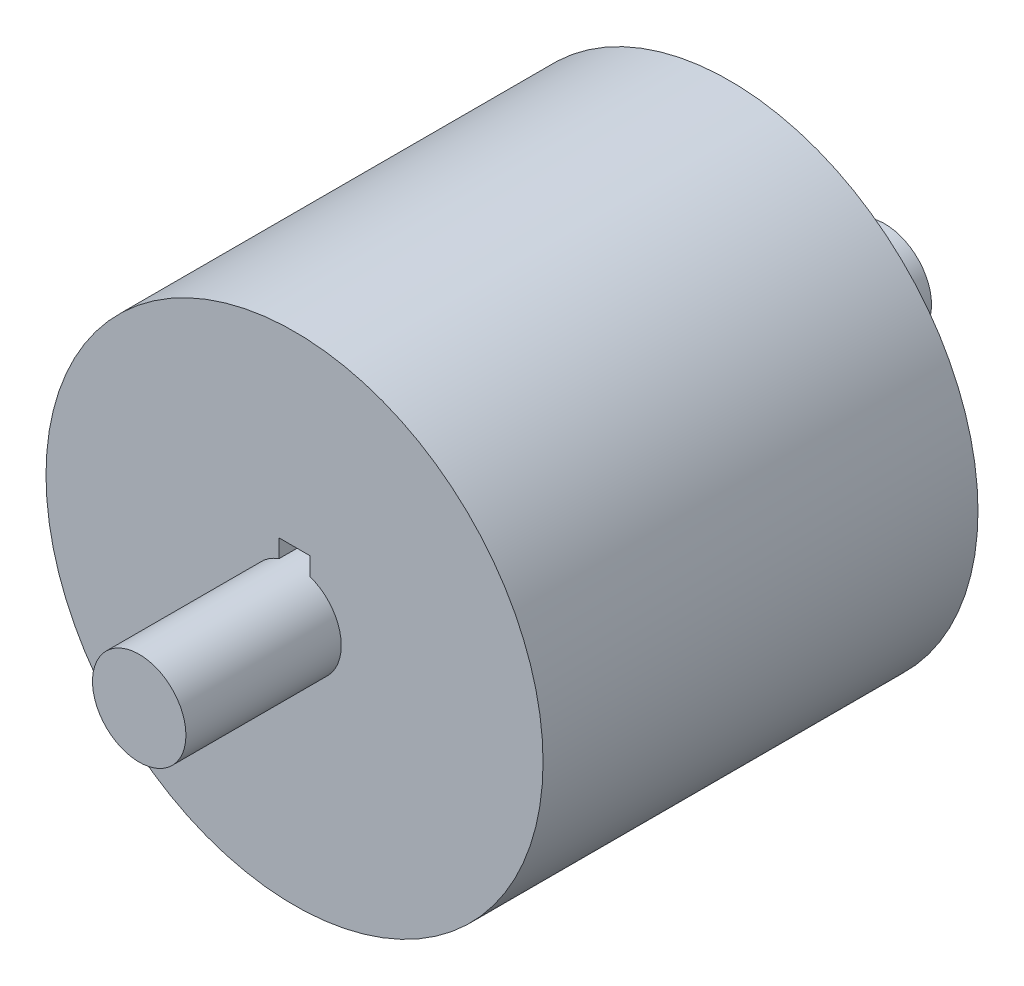
ISO-10303-21;
HEADER;
FILE_DESCRIPTION(('STEP AP214'),'2;1');
FILE_NAME('part.step','',(''),(''),'','','');
FILE_SCHEMA(('AUTOMOTIVE_DESIGN { 1 0 10303 214 1 1 1 1 }'));
ENDSEC;
DATA;
#1=APPLICATION_CONTEXT('core data for automotive mechanical design processes');
#2=APPLICATION_PROTOCOL_DEFINITION('international standard','automotive_design',2000,#1);
#3=PRODUCT_CONTEXT('',#1,'mechanical');
#4=PRODUCT('Part','Part','',(#3));
#5=PRODUCT_RELATED_PRODUCT_CATEGORY('part','',(#4));
#6=PRODUCT_DEFINITION_FORMATION('','',#4);
#7=PRODUCT_DEFINITION_CONTEXT('part definition',#1,'design');
#8=PRODUCT_DEFINITION('design','',#6,#7);
#9=PRODUCT_DEFINITION_SHAPE('','',#8);
#10=(LENGTH_UNIT() NAMED_UNIT(*) SI_UNIT(.MILLI.,.METRE.));
#11=(NAMED_UNIT(*) PLANE_ANGLE_UNIT() SI_UNIT($,.RADIAN.));
#12=(NAMED_UNIT(*) SI_UNIT($,.STERADIAN.) SOLID_ANGLE_UNIT());
#13=UNCERTAINTY_MEASURE_WITH_UNIT(LENGTH_MEASURE(1.E-05),#10,'distance_accuracy_value','');
#14=(GEOMETRIC_REPRESENTATION_CONTEXT(3) GLOBAL_UNCERTAINTY_ASSIGNED_CONTEXT((#13)) GLOBAL_UNIT_ASSIGNED_CONTEXT((#10,
#11,#12)) REPRESENTATION_CONTEXT('',''));
#15=CARTESIAN_POINT('',(0.,0.,0.));
#16=DIRECTION('',(0.,0.,1.));
#17=DIRECTION('',(1.,0.,0.));
#18=AXIS2_PLACEMENT_3D('',#15,#16,#17);
#19=CARTESIAN_POINT('',(0.,0.,11.1125));
#20=DIRECTION('',(0.,0.,1.));
#21=DIRECTION('',(1.,0.,0.));
#22=AXIS2_PLACEMENT_3D('',#19,#20,#21);
#23=PLANE('',#22);
#24=CARTESIAN_POINT('',(0.,0.,11.1125));
#25=DIRECTION('',(0.,0.,1.));
#26=DIRECTION('',(1.,0.,0.));
#27=AXIS2_PLACEMENT_3D('',#24,#25,#26);
#28=CIRCLE('',#27,12.7);
#29=CARTESIAN_POINT('',(12.7,0.,11.1125));
#30=VERTEX_POINT('',#29);
#31=EDGE_CURVE('E41',#30,#30,#28,.T.);
#32=ORIENTED_EDGE('',*,*,#31,.T.);
#33=EDGE_LOOP('',(#32));
#34=FACE_BOUND('',#33,.T.);
#35=DIRECTION('',(0.,-1.,0.));
#36=VECTOR('',#35,1.);
#37=CARTESIAN_POINT('',(0.793750000000004,-28.0814213562373,11.1125));
#38=LINE('',#37,#36);
#39=CARTESIAN_POINT('',(0.79375,3.175,11.1125));
#40=VERTEX_POINT('',#39);
#41=CARTESIAN_POINT('',(0.79375,2.25179810318332,11.1125));
#42=VERTEX_POINT('',#41);
#43=EDGE_CURVE('E99',#40,#42,#38,.T.);
#44=ORIENTED_EDGE('',*,*,#43,.T.);
#45=CARTESIAN_POINT('',(0.,0.,11.1125));
#46=DIRECTION('',(0.,0.,1.));
#47=DIRECTION('',(1.,0.,0.));
#48=AXIS2_PLACEMENT_3D('',#45,#46,#47);
#49=CIRCLE('',#48,2.3876);
#50=CARTESIAN_POINT('',(-0.79375,2.25179810318332,11.1125));
#51=VERTEX_POINT('',#50);
#52=EDGE_CURVE('E48',#42,#51,#49,.F.);
#53=ORIENTED_EDGE('',*,*,#52,.T.);
#54=DIRECTION('',(0.,-1.,0.));
#55=VECTOR('',#54,1.);
#56=CARTESIAN_POINT('',(-0.793749999999996,-28.0814213562373,11.1125));
#57=LINE('',#56,#55);
#58=CARTESIAN_POINT('',(-0.79375,3.175,11.1125));
#59=VERTEX_POINT('',#58);
#60=EDGE_CURVE('E88',#59,#51,#57,.T.);
#61=ORIENTED_EDGE('',*,*,#60,.F.);
#62=DIRECTION('',(1.,0.,0.));
#63=VECTOR('',#62,1.);
#64=CARTESIAN_POINT('',(0.,3.175,11.1125));
#65=LINE('',#64,#63);
#66=EDGE_CURVE('E92',#59,#40,#65,.T.);
#67=ORIENTED_EDGE('',*,*,#66,.T.);
#68=EDGE_LOOP('',(#44,#53,#61,#67));
#69=FACE_BOUND('',#68,.T.);
#70=ADVANCED_FACE('F33',(#34,#69),#23,.T.);
#71=CARTESIAN_POINT('',(0.,0.,-11.1125));
#72=DIRECTION('',(0.,0.,1.));
#73=DIRECTION('',(1.,0.,0.));
#74=AXIS2_PLACEMENT_3D('',#71,#72,#73);
#75=PLANE('',#74);
#76=CARTESIAN_POINT('',(0.,0.,-11.1125));
#77=DIRECTION('',(0.,0.,1.));
#78=DIRECTION('',(1.,0.,0.));
#79=AXIS2_PLACEMENT_3D('',#76,#77,#78);
#80=CIRCLE('',#79,12.7);
#81=CARTESIAN_POINT('',(12.7,0.,-11.1125));
#82=VERTEX_POINT('',#81);
#83=EDGE_CURVE('E105',#82,#82,#80,.T.);
#84=ORIENTED_EDGE('',*,*,#83,.F.);
#85=EDGE_LOOP('',(#84));
#86=FACE_BOUND('',#85,.T.);
#87=CARTESIAN_POINT('',(0.,0.,-11.1125));
#88=DIRECTION('',(0.,0.,1.));
#89=DIRECTION('',(1.,0.,0.));
#90=AXIS2_PLACEMENT_3D('',#87,#88,#89);
#91=CIRCLE('',#90,2.3876);
#92=CARTESIAN_POINT('',(0.79375,2.25179810318332,-11.1125));
#93=VERTEX_POINT('',#92);
#94=CARTESIAN_POINT('',(-0.79375,2.25179810318332,-11.1125));
#95=VERTEX_POINT('',#94);
#96=EDGE_CURVE('E73',#93,#95,#91,.F.);
#97=ORIENTED_EDGE('',*,*,#96,.F.);
#98=DIRECTION('',(0.,-1.,0.));
#99=VECTOR('',#98,1.);
#100=CARTESIAN_POINT('',(0.793750000000004,-28.0814213562373,-11.1125));
#101=LINE('',#100,#99);
#102=CARTESIAN_POINT('',(0.79375,3.175,-11.1125));
#103=VERTEX_POINT('',#102);
#104=EDGE_CURVE('E81',#103,#93,#101,.T.);
#105=ORIENTED_EDGE('',*,*,#104,.F.);
#106=DIRECTION('',(1.,0.,0.));
#107=VECTOR('',#106,1.);
#108=CARTESIAN_POINT('',(0.,3.175,-11.1125));
#109=LINE('',#108,#107);
#110=CARTESIAN_POINT('',(-0.79375,3.175,-11.1125));
#111=VERTEX_POINT('',#110);
#112=EDGE_CURVE('E87',#111,#103,#109,.T.);
#113=ORIENTED_EDGE('',*,*,#112,.F.);
#114=DIRECTION('',(0.,-1.,0.));
#115=VECTOR('',#114,1.);
#116=CARTESIAN_POINT('',(-0.793749999999996,-28.0814213562373,-11.1125));
#117=LINE('',#116,#115);
#118=EDGE_CURVE('E83',#111,#95,#117,.T.);
#119=ORIENTED_EDGE('',*,*,#118,.T.);
#120=EDGE_LOOP('',(#97,#105,#113,#119));
#121=FACE_BOUND('',#120,.T.);
#122=ADVANCED_FACE('F79',(#86,#121),#75,.F.);
#123=CARTESIAN_POINT('',(-0.793749999999996,-28.0814213562373,-11.1125));
#124=DIRECTION('',(-1.,0.,0.));
#125=DIRECTION('',(0.,-1.,0.));
#126=AXIS2_PLACEMENT_3D('',#123,#124,#125);
#127=PLANE('',#126);
#128=DIRECTION('',(0.,0.,-1.));
#129=VECTOR('',#128,1.);
#130=CARTESIAN_POINT('',(-0.79375,2.25179810318332,19.05));
#131=LINE('',#130,#129);
#132=EDGE_CURVE('E95',#95,#51,#131,.F.);
#133=ORIENTED_EDGE('',*,*,#132,.F.);
#134=ORIENTED_EDGE('',*,*,#118,.F.);
#135=DIRECTION('',(0.,0.,1.));
#136=VECTOR('',#135,1.);
#137=CARTESIAN_POINT('',(-0.79375,3.175,-11.1125));
#138=LINE('',#137,#136);
#139=EDGE_CURVE('E103',#111,#59,#138,.T.);
#140=ORIENTED_EDGE('',*,*,#139,.T.);
#141=ORIENTED_EDGE('',*,*,#60,.T.);
#142=EDGE_LOOP('',(#133,#134,#140,#141));
#143=FACE_BOUND('',#142,.T.);
#144=ADVANCED_FACE('F113',(#143),#127,.F.);
#145=CARTESIAN_POINT('',(0.793750000000004,-28.0814213562373,-11.1125));
#146=DIRECTION('',(-1.,0.,0.));
#147=DIRECTION('',(0.,-1.,0.));
#148=AXIS2_PLACEMENT_3D('',#145,#146,#147);
#149=PLANE('',#148);
#150=ORIENTED_EDGE('',*,*,#104,.T.);
#151=DIRECTION('',(0.,0.,-1.));
#152=VECTOR('',#151,1.);
#153=CARTESIAN_POINT('',(0.79375,2.25179810318332,19.05));
#154=LINE('',#153,#152);
#155=EDGE_CURVE('E11',#93,#42,#154,.F.);
#156=ORIENTED_EDGE('',*,*,#155,.T.);
#157=ORIENTED_EDGE('',*,*,#43,.F.);
#158=DIRECTION('',(0.,0.,1.));
#159=VECTOR('',#158,1.);
#160=CARTESIAN_POINT('',(0.79375,3.175,-11.1125));
#161=LINE('',#160,#159);
#162=EDGE_CURVE('E55',#103,#40,#161,.T.);
#163=ORIENTED_EDGE('',*,*,#162,.F.);
#164=EDGE_LOOP('',(#150,#156,#157,#163));
#165=FACE_BOUND('',#164,.T.);
#166=ADVANCED_FACE('F86',(#165),#149,.T.);
#167=CARTESIAN_POINT('',(0.,0.,11.1125));
#168=DIRECTION('',(0.,0.,-1.));
#169=DIRECTION('',(-1.,0.,0.));
#170=AXIS2_PLACEMENT_3D('',#167,#168,#169);
#171=CYLINDRICAL_SURFACE('',#170,12.7);
#172=ORIENTED_EDGE('',*,*,#31,.F.);
#173=EDGE_LOOP('',(#172));
#174=FACE_BOUND('',#173,.T.);
#175=ORIENTED_EDGE('',*,*,#83,.T.);
#176=EDGE_LOOP('',(#175));
#177=FACE_BOUND('',#176,.T.);
#178=ADVANCED_FACE('F35',(#174,#177),#171,.T.);
#179=CARTESIAN_POINT('',(0.,3.175,-11.1125));
#180=DIRECTION('',(0.,-1.,0.));
#181=DIRECTION('',(0.,0.,-1.));
#182=AXIS2_PLACEMENT_3D('',#179,#180,#181);
#183=PLANE('',#182);
#184=ORIENTED_EDGE('',*,*,#66,.F.);
#185=ORIENTED_EDGE('',*,*,#139,.F.);
#186=ORIENTED_EDGE('',*,*,#112,.T.);
#187=ORIENTED_EDGE('',*,*,#162,.T.);
#188=EDGE_LOOP('',(#184,#185,#186,#187));
#189=FACE_BOUND('',#188,.T.);
#190=ADVANCED_FACE('F125',(#189),#183,.T.);
#191=CARTESIAN_POINT('',(0.,0.,19.05));
#192=DIRECTION('',(0.,0.,-1.));
#193=DIRECTION('',(-1.,0.,0.));
#194=AXIS2_PLACEMENT_3D('',#191,#192,#193);
#195=CYLINDRICAL_SURFACE('',#194,2.3876);
#196=CARTESIAN_POINT('',(0.,0.,-19.05));
#197=DIRECTION('',(0.,0.,1.));
#198=DIRECTION('',(1.,0.,0.));
#199=AXIS2_PLACEMENT_3D('',#196,#197,#198);
#200=CIRCLE('',#199,2.3876);
#201=CARTESIAN_POINT('',(2.3876,0.,-19.05));
#202=VERTEX_POINT('',#201);
#203=EDGE_CURVE('E144',#202,#202,#200,.T.);
#204=ORIENTED_EDGE('',*,*,#203,.T.);
#205=EDGE_LOOP('',(#204));
#206=FACE_BOUND('',#205,.T.);
#207=CARTESIAN_POINT('',(0.,0.,19.05));
#208=DIRECTION('',(0.,0.,1.));
#209=DIRECTION('',(1.,0.,0.));
#210=AXIS2_PLACEMENT_3D('',#207,#208,#209);
#211=CIRCLE('',#210,2.3876);
#212=CARTESIAN_POINT('',(2.3876,0.,19.05));
#213=VERTEX_POINT('',#212);
#214=EDGE_CURVE('E84',#213,#213,#211,.T.);
#215=ORIENTED_EDGE('',*,*,#214,.F.);
#216=EDGE_LOOP('',(#215));
#217=FACE_BOUND('',#216,.T.);
#218=ORIENTED_EDGE('',*,*,#96,.T.);
#219=ORIENTED_EDGE('',*,*,#132,.T.);
#220=ORIENTED_EDGE('',*,*,#52,.F.);
#221=ORIENTED_EDGE('',*,*,#155,.F.);
#222=EDGE_LOOP('',(#218,#219,#220,#221));
#223=FACE_BOUND('',#222,.T.);
#224=ADVANCED_FACE('F72',(#206,#217,#223),#195,.T.);
#225=CARTESIAN_POINT('',(0.,0.,19.05));
#226=DIRECTION('',(0.,0.,1.));
#227=DIRECTION('',(1.,0.,0.));
#228=AXIS2_PLACEMENT_3D('',#225,#226,#227);
#229=PLANE('',#228);
#230=ORIENTED_EDGE('',*,*,#214,.T.);
#231=EDGE_LOOP('',(#230));
#232=FACE_BOUND('',#231,.T.);
#233=ADVANCED_FACE('F131',(#232),#229,.T.);
#234=CARTESIAN_POINT('',(0.,0.,-19.05));
#235=DIRECTION('',(0.,0.,1.));
#236=DIRECTION('',(1.,0.,0.));
#237=AXIS2_PLACEMENT_3D('',#234,#235,#236);
#238=PLANE('',#237);
#239=ORIENTED_EDGE('',*,*,#203,.F.);
#240=EDGE_LOOP('',(#239));
#241=FACE_BOUND('',#240,.T.);
#242=ADVANCED_FACE('F133',(#241),#238,.F.);
#243=CLOSED_SHELL('',(#70,#122,#144,#166,#178,#190,#224,#233,#242));
#244=MANIFOLD_SOLID_BREP('B2',#243);
#245=ADVANCED_BREP_SHAPE_REPRESENTATION('',(#18,#244),#14);
#246=SHAPE_DEFINITION_REPRESENTATION(#9,#245);
ENDSEC;
END-ISO-10303-21;
